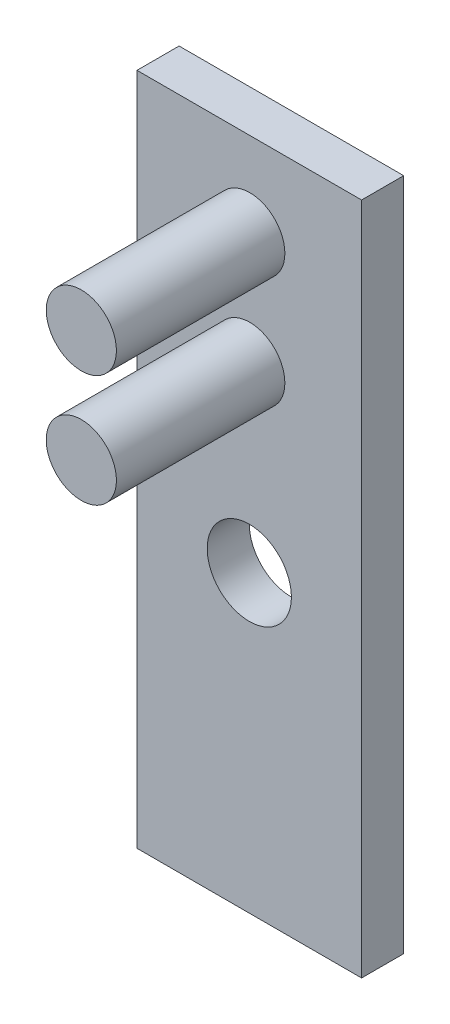
ISO-10303-21;
HEADER;
FILE_DESCRIPTION(('STEP AP214'),'2;1');
FILE_NAME('part.step','',(''),(''),'','','');
FILE_SCHEMA(('AUTOMOTIVE_DESIGN { 1 0 10303 214 1 1 1 1 }'));
ENDSEC;
DATA;
#1=APPLICATION_CONTEXT('core data for automotive mechanical design processes');
#2=APPLICATION_PROTOCOL_DEFINITION('international standard','automotive_design',2000,#1);
#3=PRODUCT_CONTEXT('',#1,'mechanical');
#4=PRODUCT('Part','Part','',(#3));
#5=PRODUCT_RELATED_PRODUCT_CATEGORY('part','',(#4));
#6=PRODUCT_DEFINITION_FORMATION('','',#4);
#7=PRODUCT_DEFINITION_CONTEXT('part definition',#1,'design');
#8=PRODUCT_DEFINITION('design','',#6,#7);
#9=PRODUCT_DEFINITION_SHAPE('','',#8);
#10=(LENGTH_UNIT() NAMED_UNIT(*) SI_UNIT(.MILLI.,.METRE.));
#11=(NAMED_UNIT(*) PLANE_ANGLE_UNIT() SI_UNIT($,.RADIAN.));
#12=(NAMED_UNIT(*) SI_UNIT($,.STERADIAN.) SOLID_ANGLE_UNIT());
#13=UNCERTAINTY_MEASURE_WITH_UNIT(LENGTH_MEASURE(1.E-05),#10,'distance_accuracy_value','');
#14=(GEOMETRIC_REPRESENTATION_CONTEXT(3) GLOBAL_UNCERTAINTY_ASSIGNED_CONTEXT((#13)) GLOBAL_UNIT_ASSIGNED_CONTEXT((#10,
#11,#12)) REPRESENTATION_CONTEXT('',''));
#15=CARTESIAN_POINT('',(0.,0.,0.));
#16=DIRECTION('',(0.,0.,1.));
#17=DIRECTION('',(1.,0.,0.));
#18=AXIS2_PLACEMENT_3D('',#15,#16,#17);
#19=CARTESIAN_POINT('',(-15.9824945295405,8.95404814004376,1.5));
#20=DIRECTION('',(1.,0.,0.));
#21=DIRECTION('',(0.,1.,0.));
#22=AXIS2_PLACEMENT_3D('',#19,#20,#21);
#23=PLANE('',#22);
#24=DIRECTION('',(0.,-1.,0.));
#25=VECTOR('',#24,1.);
#26=CARTESIAN_POINT('',(-15.9824945295405,8.95404814004376,0.));
#27=LINE('',#26,#25);
#28=CARTESIAN_POINT('',(-15.9824945295405,8.95404814004376,0.));
#29=VERTEX_POINT('',#28);
#30=CARTESIAN_POINT('',(-15.9824945295405,-15.0459518599562,0.));
#31=VERTEX_POINT('',#30);
#32=EDGE_CURVE('E102',#29,#31,#27,.T.);
#33=ORIENTED_EDGE('',*,*,#32,.T.);
#34=DIRECTION('',(0.,0.,-1.));
#35=VECTOR('',#34,1.);
#36=CARTESIAN_POINT('',(-15.9824945295405,-15.0459518599562,1.5));
#37=LINE('',#36,#35);
#38=CARTESIAN_POINT('',(-15.9824945295405,-15.0459518599562,1.5));
#39=VERTEX_POINT('',#38);
#40=EDGE_CURVE('E11',#39,#31,#37,.T.);
#41=ORIENTED_EDGE('',*,*,#40,.F.);
#42=DIRECTION('',(0.,-1.,0.));
#43=VECTOR('',#42,1.);
#44=CARTESIAN_POINT('',(-15.9824945295405,8.95404814004376,1.5));
#45=LINE('',#44,#43);
#46=CARTESIAN_POINT('',(-15.9824945295405,8.95404814004376,1.5));
#47=VERTEX_POINT('',#46);
#48=EDGE_CURVE('E90',#47,#39,#45,.T.);
#49=ORIENTED_EDGE('',*,*,#48,.F.);
#50=DIRECTION('',(0.,0.,-1.));
#51=VECTOR('',#50,1.);
#52=CARTESIAN_POINT('',(-15.9824945295405,8.95404814004376,1.5));
#53=LINE('',#52,#51);
#54=EDGE_CURVE('E98',#47,#29,#53,.T.);
#55=ORIENTED_EDGE('',*,*,#54,.T.);
#56=EDGE_LOOP('',(#33,#41,#49,#55));
#57=FACE_BOUND('',#56,.T.);
#58=ADVANCED_FACE('F39',(#57),#23,.F.);
#59=CARTESIAN_POINT('',(-15.9824945295405,-15.0459518599562,1.5));
#60=DIRECTION('',(0.,1.,0.));
#61=DIRECTION('',(0.,0.,1.));
#62=AXIS2_PLACEMENT_3D('',#59,#60,#61);
#63=PLANE('',#62);
#64=DIRECTION('',(1.,0.,0.));
#65=VECTOR('',#64,1.);
#66=CARTESIAN_POINT('',(-15.9824945295405,-15.0459518599562,0.));
#67=LINE('',#66,#65);
#68=CARTESIAN_POINT('',(-7.98249452954048,-15.0459518599562,0.));
#69=VERTEX_POINT('',#68);
#70=EDGE_CURVE('E94',#31,#69,#67,.T.);
#71=ORIENTED_EDGE('',*,*,#70,.T.);
#72=DIRECTION('',(0.,0.,-1.));
#73=VECTOR('',#72,1.);
#74=CARTESIAN_POINT('',(-7.98249452954048,-15.0459518599562,1.5));
#75=LINE('',#74,#73);
#76=CARTESIAN_POINT('',(-7.98249452954048,-15.0459518599562,1.5));
#77=VERTEX_POINT('',#76);
#78=EDGE_CURVE('E47',#77,#69,#75,.T.);
#79=ORIENTED_EDGE('',*,*,#78,.F.);
#80=DIRECTION('',(1.,0.,0.));
#81=VECTOR('',#80,1.);
#82=CARTESIAN_POINT('',(-15.9824945295405,-15.0459518599562,1.5));
#83=LINE('',#82,#81);
#84=EDGE_CURVE('E85',#39,#77,#83,.T.);
#85=ORIENTED_EDGE('',*,*,#84,.F.);
#86=ORIENTED_EDGE('',*,*,#40,.T.);
#87=EDGE_LOOP('',(#71,#79,#85,#86));
#88=FACE_BOUND('',#87,.T.);
#89=ADVANCED_FACE('F93',(#88),#63,.F.);
#90=CARTESIAN_POINT('',(-7.98249452954048,8.95404814004376,1.5));
#91=DIRECTION('',(-1.,0.,0.));
#92=DIRECTION('',(0.,0.,1.));
#93=AXIS2_PLACEMENT_3D('',#90,#91,#92);
#94=PLANE('',#93);
#95=DIRECTION('',(0.,1.,0.));
#96=VECTOR('',#95,1.);
#97=CARTESIAN_POINT('',(-7.98249452954048,8.95404814004376,0.));
#98=LINE('',#97,#96);
#99=CARTESIAN_POINT('',(-7.98249452954048,8.95404814004376,0.));
#100=VERTEX_POINT('',#99);
#101=EDGE_CURVE('E72',#69,#100,#98,.T.);
#102=ORIENTED_EDGE('',*,*,#101,.T.);
#103=DIRECTION('',(0.,0.,-1.));
#104=VECTOR('',#103,1.);
#105=CARTESIAN_POINT('',(-7.98249452954048,8.95404814004376,1.5));
#106=LINE('',#105,#104);
#107=CARTESIAN_POINT('',(-7.98249452954048,8.95404814004376,1.5));
#108=VERTEX_POINT('',#107);
#109=EDGE_CURVE('E95',#108,#100,#106,.T.);
#110=ORIENTED_EDGE('',*,*,#109,.F.);
#111=DIRECTION('',(0.,1.,0.));
#112=VECTOR('',#111,1.);
#113=CARTESIAN_POINT('',(-7.98249452954048,8.95404814004376,1.5));
#114=LINE('',#113,#112);
#115=EDGE_CURVE('E88',#77,#108,#114,.T.);
#116=ORIENTED_EDGE('',*,*,#115,.F.);
#117=ORIENTED_EDGE('',*,*,#78,.T.);
#118=EDGE_LOOP('',(#102,#110,#116,#117));
#119=FACE_BOUND('',#118,.T.);
#120=ADVANCED_FACE('F96',(#119),#94,.F.);
#121=CARTESIAN_POINT('',(-15.9824945295405,8.95404814004376,1.5));
#122=DIRECTION('',(0.,-1.,0.));
#123=DIRECTION('',(0.,0.,-1.));
#124=AXIS2_PLACEMENT_3D('',#121,#122,#123);
#125=PLANE('',#124);
#126=DIRECTION('',(-1.,0.,0.));
#127=VECTOR('',#126,1.);
#128=CARTESIAN_POINT('',(-15.9824945295405,8.95404814004376,0.));
#129=LINE('',#128,#127);
#130=EDGE_CURVE('E78',#100,#29,#129,.T.);
#131=ORIENTED_EDGE('',*,*,#130,.T.);
#132=ORIENTED_EDGE('',*,*,#54,.F.);
#133=DIRECTION('',(-1.,0.,0.));
#134=VECTOR('',#133,1.);
#135=CARTESIAN_POINT('',(-15.9824945295405,8.95404814004376,1.5));
#136=LINE('',#135,#134);
#137=EDGE_CURVE('E55',#108,#47,#136,.T.);
#138=ORIENTED_EDGE('',*,*,#137,.F.);
#139=ORIENTED_EDGE('',*,*,#109,.T.);
#140=EDGE_LOOP('',(#131,#132,#138,#139));
#141=FACE_BOUND('',#140,.T.);
#142=ADVANCED_FACE('F110',(#141),#125,.F.);
#143=CARTESIAN_POINT('',(0.,0.,1.5));
#144=DIRECTION('',(0.,0.,1.));
#145=DIRECTION('',(1.,0.,0.));
#146=AXIS2_PLACEMENT_3D('',#143,#144,#145);
#147=PLANE('',#146);
#148=CARTESIAN_POINT('',(-11.9656841967266,5.94032295714074,1.5));
#149=DIRECTION('',(0.,0.,1.));
#150=DIRECTION('',(1.,0.,0.));
#151=AXIS2_PLACEMENT_3D('',#148,#149,#150);
#152=CIRCLE('',#151,1.25);
#153=CARTESIAN_POINT('',(-10.7156841967266,5.94032295714074,1.5));
#154=VERTEX_POINT('',#153);
#155=EDGE_CURVE('E125',#154,#154,#152,.T.);
#156=ORIENTED_EDGE('',*,*,#155,.F.);
#157=EDGE_LOOP('',(#156));
#158=FACE_BOUND('',#157,.T.);
#159=CARTESIAN_POINT('',(-11.9656841967266,1.94032295714074,1.5));
#160=DIRECTION('',(0.,0.,1.));
#161=DIRECTION('',(1.,0.,0.));
#162=AXIS2_PLACEMENT_3D('',#159,#160,#161);
#163=CIRCLE('',#162,1.25);
#164=CARTESIAN_POINT('',(-10.7156841967266,1.94032295714074,1.5));
#165=VERTEX_POINT('',#164);
#166=EDGE_CURVE('E122',#165,#165,#163,.T.);
#167=ORIENTED_EDGE('',*,*,#166,.F.);
#168=EDGE_LOOP('',(#167));
#169=FACE_BOUND('',#168,.T.);
#170=CARTESIAN_POINT('',(-11.9824945295405,-4.54595185995624,1.5));
#171=DIRECTION('',(0.,0.,1.));
#172=DIRECTION('',(1.,0.,0.));
#173=AXIS2_PLACEMENT_3D('',#170,#171,#172);
#174=CIRCLE('',#173,1.5);
#175=CARTESIAN_POINT('',(-10.4824945295405,-4.54595185995624,1.5));
#176=VERTEX_POINT('',#175);
#177=EDGE_CURVE('E116',#176,#176,#174,.T.);
#178=ORIENTED_EDGE('',*,*,#177,.F.);
#179=EDGE_LOOP('',(#178));
#180=FACE_BOUND('',#179,.T.);
#181=ORIENTED_EDGE('',*,*,#48,.T.);
#182=ORIENTED_EDGE('',*,*,#84,.T.);
#183=ORIENTED_EDGE('',*,*,#115,.T.);
#184=ORIENTED_EDGE('',*,*,#137,.T.);
#185=EDGE_LOOP('',(#181,#182,#183,#184));
#186=FACE_BOUND('',#185,.T.);
#187=ADVANCED_FACE('F86',(#158,#169,#180,#186),#147,.T.);
#188=CARTESIAN_POINT('',(0.,0.,0.));
#189=DIRECTION('',(0.,0.,1.));
#190=DIRECTION('',(1.,0.,0.));
#191=AXIS2_PLACEMENT_3D('',#188,#189,#190);
#192=PLANE('',#191);
#193=CARTESIAN_POINT('',(-11.9824945295405,-4.54595185995624,0.));
#194=DIRECTION('',(0.,0.,1.));
#195=DIRECTION('',(1.,0.,0.));
#196=AXIS2_PLACEMENT_3D('',#193,#194,#195);
#197=CIRCLE('',#196,1.5);
#198=CARTESIAN_POINT('',(-10.4824945295405,-4.54595185995624,0.));
#199=VERTEX_POINT('',#198);
#200=EDGE_CURVE('E105',#199,#199,#197,.T.);
#201=ORIENTED_EDGE('',*,*,#200,.T.);
#202=EDGE_LOOP('',(#201));
#203=FACE_BOUND('',#202,.T.);
#204=ORIENTED_EDGE('',*,*,#32,.F.);
#205=ORIENTED_EDGE('',*,*,#130,.F.);
#206=ORIENTED_EDGE('',*,*,#101,.F.);
#207=ORIENTED_EDGE('',*,*,#70,.F.);
#208=EDGE_LOOP('',(#204,#205,#206,#207));
#209=FACE_BOUND('',#208,.T.);
#210=ADVANCED_FACE('F113',(#203,#209),#192,.F.);
#211=CARTESIAN_POINT('',(-11.9824945295405,-4.54595185995624,0.));
#212=DIRECTION('',(0.,0.,1.));
#213=DIRECTION('',(1.,0.,0.));
#214=AXIS2_PLACEMENT_3D('',#211,#212,#213);
#215=CYLINDRICAL_SURFACE('',#214,1.5);
#216=ORIENTED_EDGE('',*,*,#200,.F.);
#217=EDGE_LOOP('',(#216));
#218=FACE_BOUND('',#217,.T.);
#219=ORIENTED_EDGE('',*,*,#177,.T.);
#220=EDGE_LOOP('',(#219));
#221=FACE_BOUND('',#220,.T.);
#222=ADVANCED_FACE('F143',(#218,#221),#215,.F.);
#223=CARTESIAN_POINT('',(-11.9656841967266,1.94032295714074,7.5));
#224=DIRECTION('',(0.,0.,-1.));
#225=DIRECTION('',(-1.,0.,0.));
#226=AXIS2_PLACEMENT_3D('',#223,#224,#225);
#227=CYLINDRICAL_SURFACE('',#226,1.25);
#228=CARTESIAN_POINT('',(-11.9656841967266,1.94032295714074,7.5));
#229=DIRECTION('',(0.,0.,1.));
#230=DIRECTION('',(1.,0.,0.));
#231=AXIS2_PLACEMENT_3D('',#228,#229,#230);
#232=CIRCLE('',#231,1.25);
#233=CARTESIAN_POINT('',(-10.7156841967266,1.94032295714074,7.5));
#234=VERTEX_POINT('',#233);
#235=EDGE_CURVE('E119',#234,#234,#232,.T.);
#236=ORIENTED_EDGE('',*,*,#235,.F.);
#237=EDGE_LOOP('',(#236));
#238=FACE_BOUND('',#237,.T.);
#239=ORIENTED_EDGE('',*,*,#166,.T.);
#240=EDGE_LOOP('',(#239));
#241=FACE_BOUND('',#240,.T.);
#242=ADVANCED_FACE('F145',(#238,#241),#227,.T.);
#243=CARTESIAN_POINT('',(-11.9656841967266,1.94032295714074,7.5));
#244=DIRECTION('',(0.,0.,1.));
#245=DIRECTION('',(1.,0.,0.));
#246=AXIS2_PLACEMENT_3D('',#243,#244,#245);
#247=PLANE('',#246);
#248=ORIENTED_EDGE('',*,*,#235,.T.);
#249=EDGE_LOOP('',(#248));
#250=FACE_BOUND('',#249,.T.);
#251=ADVANCED_FACE('F152',(#250),#247,.T.);
#252=CARTESIAN_POINT('',(-11.9656841967266,5.94032295714074,7.5));
#253=DIRECTION('',(0.,0.,-1.));
#254=DIRECTION('',(-1.,0.,0.));
#255=AXIS2_PLACEMENT_3D('',#252,#253,#254);
#256=CYLINDRICAL_SURFACE('',#255,1.25);
#257=CARTESIAN_POINT('',(-11.9656841967266,5.94032295714074,7.5));
#258=DIRECTION('',(0.,0.,1.));
#259=DIRECTION('',(1.,0.,0.));
#260=AXIS2_PLACEMENT_3D('',#257,#258,#259);
#261=CIRCLE('',#260,1.25);
#262=CARTESIAN_POINT('',(-10.7156841967266,5.94032295714074,7.5));
#263=VERTEX_POINT('',#262);
#264=EDGE_CURVE('E128',#263,#263,#261,.T.);
#265=ORIENTED_EDGE('',*,*,#264,.F.);
#266=EDGE_LOOP('',(#265));
#267=FACE_BOUND('',#266,.T.);
#268=ORIENTED_EDGE('',*,*,#155,.T.);
#269=EDGE_LOOP('',(#268));
#270=FACE_BOUND('',#269,.T.);
#271=ADVANCED_FACE('F134',(#267,#270),#256,.T.);
#272=CARTESIAN_POINT('',(-11.9656841967266,5.94032295714074,7.5));
#273=DIRECTION('',(0.,0.,1.));
#274=DIRECTION('',(1.,0.,0.));
#275=AXIS2_PLACEMENT_3D('',#272,#273,#274);
#276=PLANE('',#275);
#277=ORIENTED_EDGE('',*,*,#264,.T.);
#278=EDGE_LOOP('',(#277));
#279=FACE_BOUND('',#278,.T.);
#280=ADVANCED_FACE('F207',(#279),#276,.T.);
#281=CLOSED_SHELL('',(#58,#89,#120,#142,#187,#210,#222,#242,#251,#271,#280));
#282=MANIFOLD_SOLID_BREP('B2',#281);
#283=ADVANCED_BREP_SHAPE_REPRESENTATION('',(#18,#282),#14);
#284=SHAPE_DEFINITION_REPRESENTATION(#9,#283);
ENDSEC;
END-ISO-10303-21;
